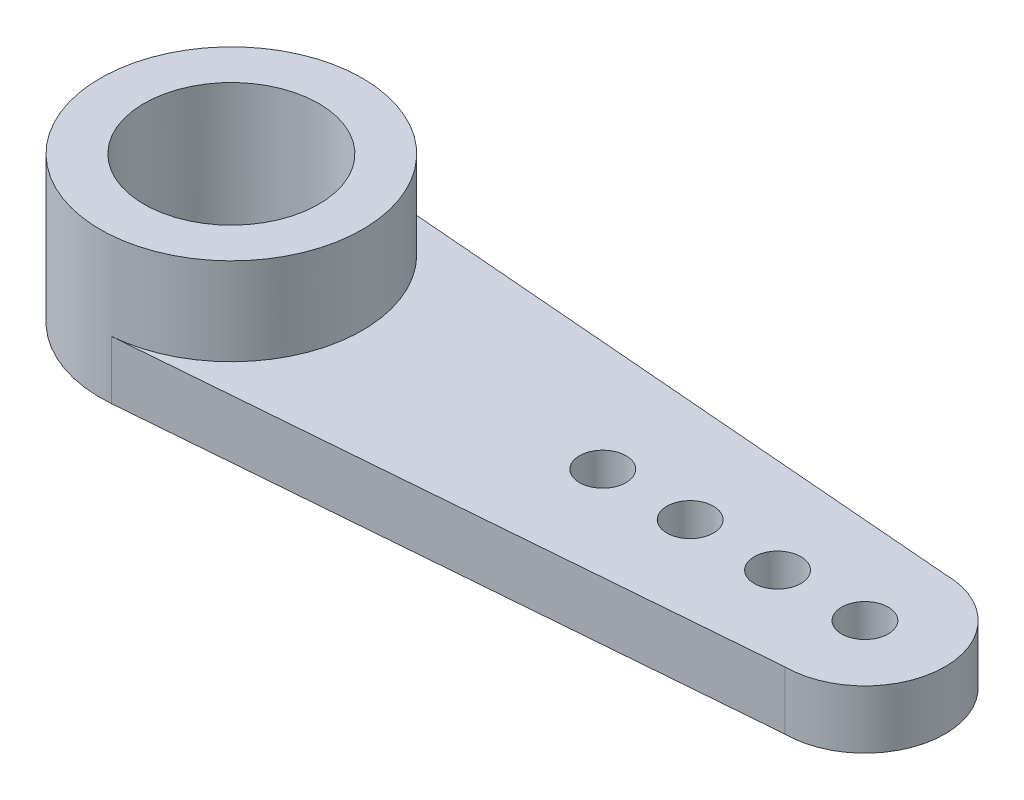
ISO-10303-21;
HEADER;
FILE_DESCRIPTION(('STEP AP214'),'2;1');
FILE_NAME('part.step','',(''),(''),'','','');
FILE_SCHEMA(('AUTOMOTIVE_DESIGN { 1 0 10303 214 1 1 1 1 }'));
ENDSEC;
DATA;
#1=APPLICATION_CONTEXT('core data for automotive mechanical design processes');
#2=APPLICATION_PROTOCOL_DEFINITION('international standard','automotive_design',2000,#1);
#3=PRODUCT_CONTEXT('',#1,'mechanical');
#4=PRODUCT('Part','Part','',(#3));
#5=PRODUCT_RELATED_PRODUCT_CATEGORY('part','',(#4));
#6=PRODUCT_DEFINITION_FORMATION('','',#4);
#7=PRODUCT_DEFINITION_CONTEXT('part definition',#1,'design');
#8=PRODUCT_DEFINITION('design','',#6,#7);
#9=PRODUCT_DEFINITION_SHAPE('','',#8);
#10=(LENGTH_UNIT() NAMED_UNIT(*) SI_UNIT(.MILLI.,.METRE.));
#11=(NAMED_UNIT(*) PLANE_ANGLE_UNIT() SI_UNIT($,.RADIAN.));
#12=(NAMED_UNIT(*) SI_UNIT($,.STERADIAN.) SOLID_ANGLE_UNIT());
#13=UNCERTAINTY_MEASURE_WITH_UNIT(LENGTH_MEASURE(1.E-05),#10,'distance_accuracy_value','');
#14=(GEOMETRIC_REPRESENTATION_CONTEXT(3) GLOBAL_UNCERTAINTY_ASSIGNED_CONTEXT((#13)) GLOBAL_UNIT_ASSIGNED_CONTEXT((#10,
#11,#12)) REPRESENTATION_CONTEXT('',''));
#15=CARTESIAN_POINT('',(0.,0.,0.));
#16=DIRECTION('',(0.,0.,1.));
#17=DIRECTION('',(1.,0.,0.));
#18=AXIS2_PLACEMENT_3D('',#15,#16,#17);
#19=CARTESIAN_POINT('',(0.,2.,0.));
#20=DIRECTION('',(0.,1.,0.));
#21=DIRECTION('',(0.,0.,1.));
#22=AXIS2_PLACEMENT_3D('',#19,#20,#21);
#23=PLANE('',#22);
#24=CARTESIAN_POINT('',(21.75,2.,0.));
#25=DIRECTION('',(0.,1.,0.));
#26=DIRECTION('',(0.,0.,1.));
#27=AXIS2_PLACEMENT_3D('',#24,#25,#26);
#28=CIRCLE('',#27,0.800000000000003);
#29=CARTESIAN_POINT('',(21.75,2.,0.800000000000003));
#30=VERTEX_POINT('',#29);
#31=EDGE_CURVE('E104',#30,#30,#28,.T.);
#32=ORIENTED_EDGE('',*,*,#31,.F.);
#33=EDGE_LOOP('',(#32));
#34=FACE_BOUND('',#33,.T.);
#35=CARTESIAN_POINT('',(15.75,2.,0.));
#36=DIRECTION('',(0.,1.,0.));
#37=DIRECTION('',(0.,0.,1.));
#38=AXIS2_PLACEMENT_3D('',#35,#36,#37);
#39=CIRCLE('',#38,0.800000000000003);
#40=CARTESIAN_POINT('',(15.75,2.,0.800000000000003));
#41=VERTEX_POINT('',#40);
#42=EDGE_CURVE('E132',#41,#41,#39,.T.);
#43=ORIENTED_EDGE('',*,*,#42,.F.);
#44=EDGE_LOOP('',(#43));
#45=FACE_BOUND('',#44,.T.);
#46=CARTESIAN_POINT('',(12.75,2.,0.));
#47=DIRECTION('',(0.,1.,0.));
#48=DIRECTION('',(0.,0.,1.));
#49=AXIS2_PLACEMENT_3D('',#46,#47,#48);
#50=CIRCLE('',#49,0.800000000000001);
#51=CARTESIAN_POINT('',(12.75,2.,0.800000000000001));
#52=VERTEX_POINT('',#51);
#53=EDGE_CURVE('E128',#52,#52,#50,.T.);
#54=ORIENTED_EDGE('',*,*,#53,.F.);
#55=EDGE_LOOP('',(#54));
#56=FACE_BOUND('',#55,.T.);
#57=CARTESIAN_POINT('',(18.75,2.,0.));
#58=DIRECTION('',(0.,1.,0.));
#59=DIRECTION('',(0.,0.,1.));
#60=AXIS2_PLACEMENT_3D('',#57,#58,#59);
#61=CIRCLE('',#60,0.800000000000003);
#62=CARTESIAN_POINT('',(18.75,2.,0.800000000000003));
#63=VERTEX_POINT('',#62);
#64=EDGE_CURVE('E138',#63,#63,#61,.T.);
#65=ORIENTED_EDGE('',*,*,#64,.F.);
#66=EDGE_LOOP('',(#65));
#67=FACE_BOUND('',#66,.T.);
#68=DIRECTION('',(-0.996724338402031,0.,-0.0808739342250308));
#69=VECTOR('',#68,1.);
#70=CARTESIAN_POINT('',(0.363932704012638,2.,-4.48525952280914));
#71=LINE('',#70,#69);
#72=CARTESIAN_POINT('',(21.75,2.,-2.75));
#73=VERTEX_POINT('',#72);
#74=CARTESIAN_POINT('',(0.363932704012638,2.,-4.48525952280914));
#75=VERTEX_POINT('',#74);
#76=EDGE_CURVE('E51',#73,#75,#71,.T.);
#77=ORIENTED_EDGE('',*,*,#76,.T.);
#78=CARTESIAN_POINT('',(0.,2.,0.));
#79=DIRECTION('',(0.,-1.,0.));
#80=DIRECTION('',(0.,0.,-1.));
#81=AXIS2_PLACEMENT_3D('',#78,#79,#80);
#82=CIRCLE('',#81,4.5);
#83=CARTESIAN_POINT('',(0.363932704012638,2.,4.48525952280914));
#84=VERTEX_POINT('',#83);
#85=EDGE_CURVE('E86',#75,#84,#82,.T.);
#86=ORIENTED_EDGE('',*,*,#85,.T.);
#87=DIRECTION('',(0.996724338402031,0.,-0.0808739342250308));
#88=VECTOR('',#87,1.);
#89=CARTESIAN_POINT('',(0.363932704012638,2.,4.48525952280914));
#90=LINE('',#89,#88);
#91=CARTESIAN_POINT('',(21.75,2.,2.75));
#92=VERTEX_POINT('',#91);
#93=EDGE_CURVE('E78',#84,#92,#90,.T.);
#94=ORIENTED_EDGE('',*,*,#93,.T.);
#95=CARTESIAN_POINT('',(21.75,2.,0.));
#96=DIRECTION('',(0.,1.,0.));
#97=DIRECTION('',(0.,0.,1.));
#98=AXIS2_PLACEMENT_3D('',#95,#96,#97);
#99=CIRCLE('',#98,2.75);
#100=EDGE_CURVE('E92',#92,#73,#99,.T.);
#101=ORIENTED_EDGE('',*,*,#100,.T.);
#102=EDGE_LOOP('',(#77,#86,#94,#101));
#103=FACE_BOUND('',#102,.T.);
#104=ADVANCED_FACE('F32',(#34,#45,#56,#67,#103),#23,.T.);
#105=CARTESIAN_POINT('',(0.,0.,0.));
#106=DIRECTION('',(0.,1.,0.));
#107=DIRECTION('',(0.,0.,1.));
#108=AXIS2_PLACEMENT_3D('',#105,#106,#107);
#109=PLANE('',#108);
#110=CARTESIAN_POINT('',(18.75,0.,0.));
#111=DIRECTION('',(0.,1.,0.));
#112=DIRECTION('',(0.,0.,1.));
#113=AXIS2_PLACEMENT_3D('',#110,#111,#112);
#114=CIRCLE('',#113,0.800000000000003);
#115=CARTESIAN_POINT('',(18.75,0.,0.800000000000003));
#116=VERTEX_POINT('',#115);
#117=EDGE_CURVE('E141',#116,#116,#114,.T.);
#118=ORIENTED_EDGE('',*,*,#117,.T.);
#119=EDGE_LOOP('',(#118));
#120=FACE_BOUND('',#119,.T.);
#121=CARTESIAN_POINT('',(12.75,0.,0.));
#122=DIRECTION('',(0.,1.,0.));
#123=DIRECTION('',(0.,0.,1.));
#124=AXIS2_PLACEMENT_3D('',#121,#122,#123);
#125=CIRCLE('',#124,0.800000000000001);
#126=CARTESIAN_POINT('',(12.75,0.,0.800000000000001));
#127=VERTEX_POINT('',#126);
#128=EDGE_CURVE('E129',#127,#127,#125,.T.);
#129=ORIENTED_EDGE('',*,*,#128,.T.);
#130=EDGE_LOOP('',(#129));
#131=FACE_BOUND('',#130,.T.);
#132=CARTESIAN_POINT('',(0.,0.,0.));
#133=DIRECTION('',(0.,1.,0.));
#134=DIRECTION('',(0.,0.,1.));
#135=AXIS2_PLACEMENT_3D('',#132,#133,#134);
#136=CIRCLE('',#135,4.5);
#137=CARTESIAN_POINT('',(0.363932704012638,0.,-4.48525952280914));
#138=VERTEX_POINT('',#137);
#139=CARTESIAN_POINT('',(0.363932704012638,0.,4.48525952280914));
#140=VERTEX_POINT('',#139);
#141=EDGE_CURVE('E88',#138,#140,#136,.T.);
#142=ORIENTED_EDGE('',*,*,#141,.F.);
#143=DIRECTION('',(-0.996724338402031,0.,-0.0808739342250308));
#144=VECTOR('',#143,1.);
#145=CARTESIAN_POINT('',(0.363932704012638,0.,-4.48525952280914));
#146=LINE('',#145,#144);
#147=CARTESIAN_POINT('',(21.75,0.,-2.75));
#148=VERTEX_POINT('',#147);
#149=EDGE_CURVE('E74',#148,#138,#146,.T.);
#150=ORIENTED_EDGE('',*,*,#149,.F.);
#151=CARTESIAN_POINT('',(21.75,0.,0.));
#152=DIRECTION('',(0.,1.,0.));
#153=DIRECTION('',(0.,0.,1.));
#154=AXIS2_PLACEMENT_3D('',#151,#152,#153);
#155=CIRCLE('',#154,2.75);
#156=CARTESIAN_POINT('',(21.75,0.,2.75));
#157=VERTEX_POINT('',#156);
#158=EDGE_CURVE('E69',#157,#148,#155,.T.);
#159=ORIENTED_EDGE('',*,*,#158,.F.);
#160=DIRECTION('',(0.996724338402031,0.,-0.0808739342250308));
#161=VECTOR('',#160,1.);
#162=CARTESIAN_POINT('',(0.363932704012638,0.,4.48525952280914));
#163=LINE('',#162,#161);
#164=EDGE_CURVE('E121',#140,#157,#163,.T.);
#165=ORIENTED_EDGE('',*,*,#164,.F.);
#166=EDGE_LOOP('',(#142,#150,#159,#165));
#167=FACE_BOUND('',#166,.T.);
#168=CARTESIAN_POINT('',(0.,0.,0.));
#169=DIRECTION('',(0.,1.,0.));
#170=DIRECTION('',(0.,0.,1.));
#171=AXIS2_PLACEMENT_3D('',#168,#169,#170);
#172=CIRCLE('',#171,3.);
#173=CARTESIAN_POINT('',(0.,0.,3.));
#174=VERTEX_POINT('',#173);
#175=EDGE_CURVE('E124',#174,#174,#172,.T.);
#176=ORIENTED_EDGE('',*,*,#175,.T.);
#177=EDGE_LOOP('',(#176));
#178=FACE_BOUND('',#177,.T.);
#179=CARTESIAN_POINT('',(15.75,0.,0.));
#180=DIRECTION('',(0.,1.,0.));
#181=DIRECTION('',(0.,0.,1.));
#182=AXIS2_PLACEMENT_3D('',#179,#180,#181);
#183=CIRCLE('',#182,0.800000000000003);
#184=CARTESIAN_POINT('',(15.75,0.,0.800000000000003));
#185=VERTEX_POINT('',#184);
#186=EDGE_CURVE('E135',#185,#185,#183,.T.);
#187=ORIENTED_EDGE('',*,*,#186,.T.);
#188=EDGE_LOOP('',(#187));
#189=FACE_BOUND('',#188,.T.);
#190=CARTESIAN_POINT('',(21.75,0.,0.));
#191=DIRECTION('',(0.,1.,0.));
#192=DIRECTION('',(0.,0.,1.));
#193=AXIS2_PLACEMENT_3D('',#190,#191,#192);
#194=CIRCLE('',#193,0.800000000000003);
#195=CARTESIAN_POINT('',(21.75,0.,0.800000000000003));
#196=VERTEX_POINT('',#195);
#197=EDGE_CURVE('E98',#196,#196,#194,.T.);
#198=ORIENTED_EDGE('',*,*,#197,.T.);
#199=EDGE_LOOP('',(#198));
#200=FACE_BOUND('',#199,.T.);
#201=ADVANCED_FACE('F156',(#120,#131,#167,#178,#189,#200),#109,.F.);
#202=CARTESIAN_POINT('',(0.,2.,0.));
#203=DIRECTION('',(0.,-1.,0.));
#204=DIRECTION('',(0.,0.,-1.));
#205=AXIS2_PLACEMENT_3D('',#202,#203,#204);
#206=CYLINDRICAL_SURFACE('',#205,4.5);
#207=ORIENTED_EDGE('',*,*,#141,.T.);
#208=DIRECTION('',(0.,-1.,0.));
#209=VECTOR('',#208,1.);
#210=CARTESIAN_POINT('',(0.363932704012638,2.,4.48525952280914));
#211=LINE('',#210,#209);
#212=EDGE_CURVE('E11',#84,#140,#211,.T.);
#213=ORIENTED_EDGE('',*,*,#212,.F.);
#214=ORIENTED_EDGE('',*,*,#85,.F.);
#215=DIRECTION('',(0.,-1.,0.));
#216=VECTOR('',#215,1.);
#217=CARTESIAN_POINT('',(0.363932704012638,2.,-4.48525952280914));
#218=LINE('',#217,#216);
#219=EDGE_CURVE('E115',#75,#138,#218,.T.);
#220=ORIENTED_EDGE('',*,*,#219,.T.);
#221=EDGE_LOOP('',(#207,#213,#214,#220));
#222=FACE_BOUND('',#221,.T.);
#223=CARTESIAN_POINT('',(0.,5.,0.));
#224=DIRECTION('',(0.,-1.,0.));
#225=DIRECTION('',(0.,0.,-1.));
#226=AXIS2_PLACEMENT_3D('',#223,#224,#225);
#227=CIRCLE('',#226,4.5);
#228=CARTESIAN_POINT('',(0.,5.,-4.5));
#229=VERTEX_POINT('',#228);
#230=EDGE_CURVE('E94',#229,#229,#227,.T.);
#231=ORIENTED_EDGE('',*,*,#230,.T.);
#232=EDGE_LOOP('',(#231));
#233=FACE_BOUND('',#232,.T.);
#234=ADVANCED_FACE('F34',(#222,#233),#206,.T.);
#235=CARTESIAN_POINT('',(0.363932704012638,2.,4.48525952280914));
#236=DIRECTION('',(-0.0808739342250308,0.,-0.996724338402031));
#237=DIRECTION('',(-0.99672433840203,0.,0.0808739342250308));
#238=AXIS2_PLACEMENT_3D('',#235,#236,#237);
#239=PLANE('',#238);
#240=ORIENTED_EDGE('',*,*,#164,.T.);
#241=DIRECTION('',(0.,-1.,0.));
#242=VECTOR('',#241,1.);
#243=CARTESIAN_POINT('',(21.75,2.,2.75));
#244=LINE('',#243,#242);
#245=EDGE_CURVE('E42',#92,#157,#244,.T.);
#246=ORIENTED_EDGE('',*,*,#245,.F.);
#247=ORIENTED_EDGE('',*,*,#93,.F.);
#248=ORIENTED_EDGE('',*,*,#212,.T.);
#249=EDGE_LOOP('',(#240,#246,#247,#248));
#250=FACE_BOUND('',#249,.T.);
#251=ADVANCED_FACE('F90',(#250),#239,.F.);
#252=CARTESIAN_POINT('',(21.75,2.,0.));
#253=DIRECTION('',(0.,-1.,0.));
#254=DIRECTION('',(0.,0.,-1.));
#255=AXIS2_PLACEMENT_3D('',#252,#253,#254);
#256=CYLINDRICAL_SURFACE('',#255,2.75);
#257=ORIENTED_EDGE('',*,*,#158,.T.);
#258=DIRECTION('',(0.,-1.,0.));
#259=VECTOR('',#258,1.);
#260=CARTESIAN_POINT('',(21.75,2.,-2.75));
#261=LINE('',#260,#259);
#262=EDGE_CURVE('E117',#73,#148,#261,.T.);
#263=ORIENTED_EDGE('',*,*,#262,.F.);
#264=ORIENTED_EDGE('',*,*,#100,.F.);
#265=ORIENTED_EDGE('',*,*,#245,.T.);
#266=EDGE_LOOP('',(#257,#263,#264,#265));
#267=FACE_BOUND('',#266,.T.);
#268=ADVANCED_FACE('F199',(#267),#256,.T.);
#269=CARTESIAN_POINT('',(0.363932704012638,2.,-4.48525952280914));
#270=DIRECTION('',(-0.0808739342250308,0.,0.996724338402031));
#271=DIRECTION('',(0.99672433840203,0.,0.0808739342250308));
#272=AXIS2_PLACEMENT_3D('',#269,#270,#271);
#273=PLANE('',#272);
#274=ORIENTED_EDGE('',*,*,#149,.T.);
#275=ORIENTED_EDGE('',*,*,#219,.F.);
#276=ORIENTED_EDGE('',*,*,#76,.F.);
#277=ORIENTED_EDGE('',*,*,#262,.T.);
#278=EDGE_LOOP('',(#274,#275,#276,#277));
#279=FACE_BOUND('',#278,.T.);
#280=ADVANCED_FACE('F194',(#279),#273,.F.);
#281=CARTESIAN_POINT('',(0.,2.,0.));
#282=DIRECTION('',(0.,-1.,0.));
#283=DIRECTION('',(0.,0.,-1.));
#284=AXIS2_PLACEMENT_3D('',#281,#282,#283);
#285=CYLINDRICAL_SURFACE('',#284,3.);
#286=ORIENTED_EDGE('',*,*,#175,.F.);
#287=EDGE_LOOP('',(#286));
#288=FACE_BOUND('',#287,.T.);
#289=CARTESIAN_POINT('',(0.,5.,0.));
#290=DIRECTION('',(0.,-1.,0.));
#291=DIRECTION('',(0.,0.,-1.));
#292=AXIS2_PLACEMENT_3D('',#289,#290,#291);
#293=CIRCLE('',#292,3.);
#294=CARTESIAN_POINT('',(0.,5.,-3.));
#295=VERTEX_POINT('',#294);
#296=EDGE_CURVE('E95',#295,#295,#293,.T.);
#297=ORIENTED_EDGE('',*,*,#296,.F.);
#298=EDGE_LOOP('',(#297));
#299=FACE_BOUND('',#298,.T.);
#300=ADVANCED_FACE('F188',(#288,#299),#285,.F.);
#301=CARTESIAN_POINT('',(12.75,2.,0.));
#302=DIRECTION('',(0.,-1.,0.));
#303=DIRECTION('',(0.,0.,-1.));
#304=AXIS2_PLACEMENT_3D('',#301,#302,#303);
#305=CYLINDRICAL_SURFACE('',#304,0.800000000000001);
#306=ORIENTED_EDGE('',*,*,#53,.T.);
#307=EDGE_LOOP('',(#306));
#308=FACE_BOUND('',#307,.T.);
#309=ORIENTED_EDGE('',*,*,#128,.F.);
#310=EDGE_LOOP('',(#309));
#311=FACE_BOUND('',#310,.T.);
#312=ADVANCED_FACE('F182',(#308,#311),#305,.F.);
#313=CARTESIAN_POINT('',(15.75,2.,0.));
#314=DIRECTION('',(0.,-1.,0.));
#315=DIRECTION('',(0.,0.,-1.));
#316=AXIS2_PLACEMENT_3D('',#313,#314,#315);
#317=CYLINDRICAL_SURFACE('',#316,0.800000000000003);
#318=ORIENTED_EDGE('',*,*,#42,.T.);
#319=EDGE_LOOP('',(#318));
#320=FACE_BOUND('',#319,.T.);
#321=ORIENTED_EDGE('',*,*,#186,.F.);
#322=EDGE_LOOP('',(#321));
#323=FACE_BOUND('',#322,.T.);
#324=ADVANCED_FACE('F167',(#320,#323),#317,.F.);
#325=CARTESIAN_POINT('',(18.75,2.,0.));
#326=DIRECTION('',(0.,-1.,0.));
#327=DIRECTION('',(0.,0.,-1.));
#328=AXIS2_PLACEMENT_3D('',#325,#326,#327);
#329=CYLINDRICAL_SURFACE('',#328,0.800000000000003);
#330=ORIENTED_EDGE('',*,*,#64,.T.);
#331=EDGE_LOOP('',(#330));
#332=FACE_BOUND('',#331,.T.);
#333=ORIENTED_EDGE('',*,*,#117,.F.);
#334=EDGE_LOOP('',(#333));
#335=FACE_BOUND('',#334,.T.);
#336=ADVANCED_FACE('F164',(#332,#335),#329,.F.);
#337=CARTESIAN_POINT('',(21.75,2.,0.));
#338=DIRECTION('',(0.,-1.,0.));
#339=DIRECTION('',(0.,0.,-1.));
#340=AXIS2_PLACEMENT_3D('',#337,#338,#339);
#341=CYLINDRICAL_SURFACE('',#340,0.800000000000003);
#342=ORIENTED_EDGE('',*,*,#31,.T.);
#343=EDGE_LOOP('',(#342));
#344=FACE_BOUND('',#343,.T.);
#345=ORIENTED_EDGE('',*,*,#197,.F.);
#346=EDGE_LOOP('',(#345));
#347=FACE_BOUND('',#346,.T.);
#348=ADVANCED_FACE('F151',(#344,#347),#341,.F.);
#349=CARTESIAN_POINT('',(0.,5.,0.));
#350=DIRECTION('',(0.,-1.,0.));
#351=DIRECTION('',(0.,0.,-1.));
#352=AXIS2_PLACEMENT_3D('',#349,#350,#351);
#353=PLANE('',#352);
#354=ORIENTED_EDGE('',*,*,#296,.T.);
#355=EDGE_LOOP('',(#354));
#356=FACE_BOUND('',#355,.T.);
#357=ORIENTED_EDGE('',*,*,#230,.F.);
#358=EDGE_LOOP('',(#357));
#359=FACE_BOUND('',#358,.T.);
#360=ADVANCED_FACE('F225',(#356,#359),#353,.F.);
#361=CLOSED_SHELL('',(#104,#201,#234,#251,#268,#280,#300,#312,#324,#336,#348,#360));
#362=MANIFOLD_SOLID_BREP('B2',#361);
#363=ADVANCED_BREP_SHAPE_REPRESENTATION('',(#18,#362),#14);
#364=SHAPE_DEFINITION_REPRESENTATION(#9,#363);
ENDSEC;
END-ISO-10303-21;
